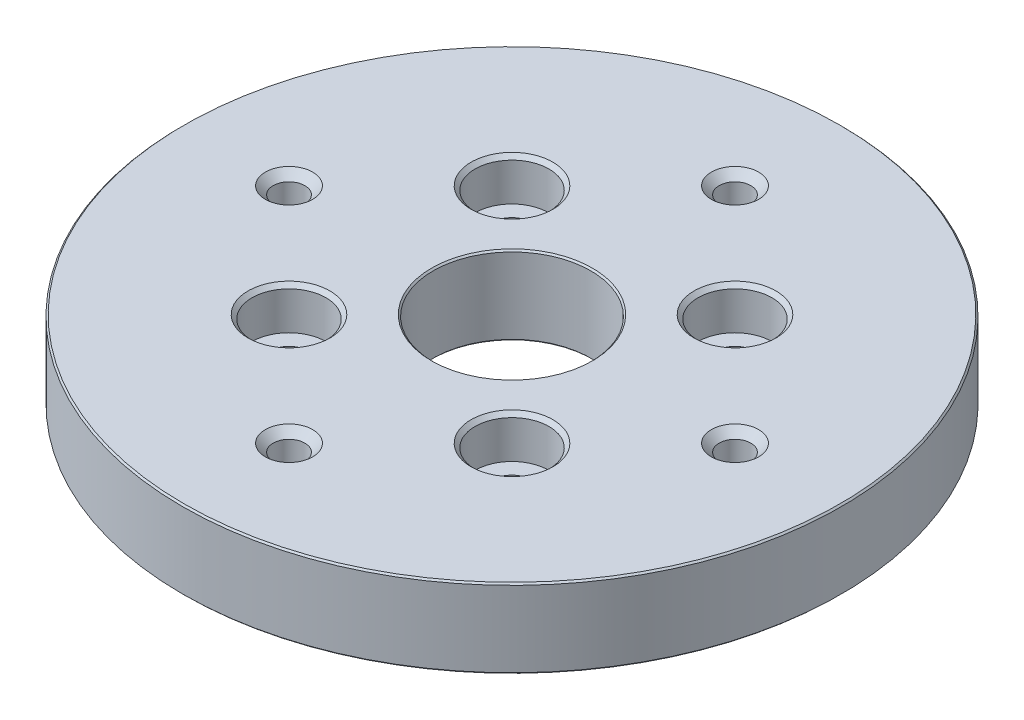
ISO-10303-21;
HEADER;
FILE_DESCRIPTION(('STEP AP214'),'2;1');
FILE_NAME('part.step','',(''),(''),'','','');
FILE_SCHEMA(('AUTOMOTIVE_DESIGN { 1 0 10303 214 1 1 1 1 }'));
ENDSEC;
DATA;
#1=APPLICATION_CONTEXT('core data for automotive mechanical design processes');
#2=APPLICATION_PROTOCOL_DEFINITION('international standard','automotive_design',2000,#1);
#3=PRODUCT_CONTEXT('',#1,'mechanical');
#4=PRODUCT('Part','Part','',(#3));
#5=PRODUCT_RELATED_PRODUCT_CATEGORY('part','',(#4));
#6=PRODUCT_DEFINITION_FORMATION('','',#4);
#7=PRODUCT_DEFINITION_CONTEXT('part definition',#1,'design');
#8=PRODUCT_DEFINITION('design','',#6,#7);
#9=PRODUCT_DEFINITION_SHAPE('','',#8);
#10=(LENGTH_UNIT() NAMED_UNIT(*) SI_UNIT(.MILLI.,.METRE.));
#11=(NAMED_UNIT(*) PLANE_ANGLE_UNIT() SI_UNIT($,.RADIAN.));
#12=(NAMED_UNIT(*) SI_UNIT($,.STERADIAN.) SOLID_ANGLE_UNIT());
#13=UNCERTAINTY_MEASURE_WITH_UNIT(LENGTH_MEASURE(1.E-05),#10,'distance_accuracy_value','');
#14=(GEOMETRIC_REPRESENTATION_CONTEXT(3) GLOBAL_UNCERTAINTY_ASSIGNED_CONTEXT((#13)) GLOBAL_UNIT_ASSIGNED_CONTEXT((#10,
#11,#12)) REPRESENTATION_CONTEXT('',''));
#15=CARTESIAN_POINT('',(0.,0.,0.));
#16=DIRECTION('',(0.,0.,1.));
#17=DIRECTION('',(1.,0.,0.));
#18=AXIS2_PLACEMENT_3D('',#15,#16,#17);
#19=CARTESIAN_POINT('',(0.,-12.7,0.));
#20=DIRECTION('',(0.,1.,0.));
#21=DIRECTION('',(0.,0.,1.));
#22=AXIS2_PLACEMENT_3D('',#19,#20,#21);
#23=CYLINDRICAL_SURFACE('',#22,53.086);
#24=CARTESIAN_POINT('',(0.,-12.446,0.));
#25=DIRECTION('',(0.,1.,0.));
#26=DIRECTION('',(0.,0.,1.));
#27=AXIS2_PLACEMENT_3D('',#24,#25,#26);
#28=CIRCLE('',#27,53.086);
#29=CARTESIAN_POINT('',(0.,-12.446,53.086));
#30=VERTEX_POINT('',#29);
#31=EDGE_CURVE('E61',#30,#30,#28,.T.);
#32=ORIENTED_EDGE('',*,*,#31,.T.);
#33=EDGE_LOOP('',(#32));
#34=FACE_BOUND('',#33,.T.);
#35=CARTESIAN_POINT('',(0.,-0.253999999999983,0.));
#36=DIRECTION('',(0.,1.,0.));
#37=DIRECTION('',(0.,0.,1.));
#38=AXIS2_PLACEMENT_3D('',#35,#36,#37);
#39=CIRCLE('',#38,53.086);
#40=CARTESIAN_POINT('',(0.,-0.253999999999983,53.086));
#41=VERTEX_POINT('',#40);
#42=EDGE_CURVE('E64',#41,#41,#39,.F.);
#43=ORIENTED_EDGE('',*,*,#42,.T.);
#44=EDGE_LOOP('',(#43));
#45=FACE_BOUND('',#44,.T.);
#46=ADVANCED_FACE('F35',(#34,#45),#23,.T.);
#47=CARTESIAN_POINT('',(0.,-12.7,0.));
#48=DIRECTION('',(0.,1.,0.));
#49=DIRECTION('',(0.,0.,1.));
#50=AXIS2_PLACEMENT_3D('',#47,#48,#49);
#51=PLANE('',#50);
#52=CARTESIAN_POINT('',(0.,-12.7,0.));
#53=DIRECTION('',(0.,1.,0.));
#54=DIRECTION('',(0.,0.,1.));
#55=AXIS2_PLACEMENT_3D('',#52,#53,#54);
#56=CIRCLE('',#55,52.832);
#57=CARTESIAN_POINT('',(0.,-12.7,52.832));
#58=VERTEX_POINT('',#57);
#59=EDGE_CURVE('E55',#58,#58,#56,.F.);
#60=ORIENTED_EDGE('',*,*,#59,.T.);
#61=EDGE_LOOP('',(#60));
#62=FACE_BOUND('',#61,.T.);
#63=CARTESIAN_POINT('',(0.,-12.7,0.));
#64=DIRECTION('',(0.,1.,0.));
#65=DIRECTION('',(0.,0.,1.));
#66=AXIS2_PLACEMENT_3D('',#63,#64,#65);
#67=CIRCLE('',#66,12.954);
#68=CARTESIAN_POINT('',(0.,-12.7,12.954));
#69=VERTEX_POINT('',#68);
#70=EDGE_CURVE('E58',#69,#69,#67,.T.);
#71=ORIENTED_EDGE('',*,*,#70,.T.);
#72=EDGE_LOOP('',(#71));
#73=FACE_BOUND('',#72,.T.);
#74=CARTESIAN_POINT('',(-17.9605122421383,-12.7,17.9605122421383));
#75=DIRECTION('',(0.,1.,0.));
#76=DIRECTION('',(0.,0.,1.));
#77=AXIS2_PLACEMENT_3D('',#74,#75,#76);
#78=CIRCLE('',#77,3.8989);
#79=CARTESIAN_POINT('',(-17.9605122421383,-12.7,21.8594122421383));
#80=VERTEX_POINT('',#79);
#81=EDGE_CURVE('E184',#80,#80,#78,.T.);
#82=ORIENTED_EDGE('',*,*,#81,.T.);
#83=EDGE_LOOP('',(#82));
#84=FACE_BOUND('',#83,.T.);
#85=CARTESIAN_POINT('',(-17.9605122421383,-12.7,-17.9605122421383));
#86=DIRECTION('',(0.,1.,0.));
#87=DIRECTION('',(0.,0.,1.));
#88=AXIS2_PLACEMENT_3D('',#85,#86,#87);
#89=CIRCLE('',#88,3.8989);
#90=CARTESIAN_POINT('',(-17.9605122421383,-12.7,-14.0616122421383));
#91=VERTEX_POINT('',#90);
#92=EDGE_CURVE('E166',#91,#91,#89,.T.);
#93=ORIENTED_EDGE('',*,*,#92,.T.);
#94=EDGE_LOOP('',(#93));
#95=FACE_BOUND('',#94,.T.);
#96=CARTESIAN_POINT('',(17.9605122421383,-12.7,-17.9605122421383));
#97=DIRECTION('',(0.,1.,0.));
#98=DIRECTION('',(0.,0.,1.));
#99=AXIS2_PLACEMENT_3D('',#96,#97,#98);
#100=CIRCLE('',#99,3.8989);
#101=CARTESIAN_POINT('',(17.9605122421383,-12.7,-14.0616122421383));
#102=VERTEX_POINT('',#101);
#103=EDGE_CURVE('E148',#102,#102,#100,.T.);
#104=ORIENTED_EDGE('',*,*,#103,.T.);
#105=EDGE_LOOP('',(#104));
#106=FACE_BOUND('',#105,.T.);
#107=CARTESIAN_POINT('',(17.9605122421383,-12.7,17.9605122421383));
#108=DIRECTION('',(0.,1.,0.));
#109=DIRECTION('',(0.,0.,1.));
#110=AXIS2_PLACEMENT_3D('',#107,#108,#109);
#111=CIRCLE('',#110,3.8989);
#112=CARTESIAN_POINT('',(17.9605122421383,-12.7,21.8594122421383));
#113=VERTEX_POINT('',#112);
#114=EDGE_CURVE('E130',#113,#113,#111,.T.);
#115=ORIENTED_EDGE('',*,*,#114,.T.);
#116=EDGE_LOOP('',(#115));
#117=FACE_BOUND('',#116,.T.);
#118=CARTESIAN_POINT('',(0.,-12.7,35.9210244842766));
#119=DIRECTION('',(0.,1.,0.));
#120=DIRECTION('',(0.,0.,1.));
#121=AXIS2_PLACEMENT_3D('',#118,#119,#120);
#122=CIRCLE('',#121,3.81);
#123=CARTESIAN_POINT('',(0.,-12.7,39.7310244842766));
#124=VERTEX_POINT('',#123);
#125=EDGE_CURVE('E112',#124,#124,#122,.T.);
#126=ORIENTED_EDGE('',*,*,#125,.T.);
#127=EDGE_LOOP('',(#126));
#128=FACE_BOUND('',#127,.T.);
#129=CARTESIAN_POINT('',(-35.9210244842766,-12.7,0.));
#130=DIRECTION('',(0.,1.,0.));
#131=DIRECTION('',(0.,0.,1.));
#132=AXIS2_PLACEMENT_3D('',#129,#130,#131);
#133=CIRCLE('',#132,3.80999999999999);
#134=CARTESIAN_POINT('',(-35.9210244842766,-12.7,3.80999999999999));
#135=VERTEX_POINT('',#134);
#136=EDGE_CURVE('E100',#135,#135,#133,.T.);
#137=ORIENTED_EDGE('',*,*,#136,.T.);
#138=EDGE_LOOP('',(#137));
#139=FACE_BOUND('',#138,.T.);
#140=CARTESIAN_POINT('',(0.,-12.7,-35.9210244842766));
#141=DIRECTION('',(0.,1.,0.));
#142=DIRECTION('',(0.,0.,1.));
#143=AXIS2_PLACEMENT_3D('',#140,#141,#142);
#144=CIRCLE('',#143,3.81);
#145=CARTESIAN_POINT('',(0.,-12.7,-32.1110244842766));
#146=VERTEX_POINT('',#145);
#147=EDGE_CURVE('E88',#146,#146,#144,.T.);
#148=ORIENTED_EDGE('',*,*,#147,.T.);
#149=EDGE_LOOP('',(#148));
#150=FACE_BOUND('',#149,.T.);
#151=CARTESIAN_POINT('',(35.9210244842766,-12.7,0.));
#152=DIRECTION('',(0.,1.,0.));
#153=DIRECTION('',(0.,0.,1.));
#154=AXIS2_PLACEMENT_3D('',#151,#152,#153);
#155=CIRCLE('',#154,3.80999999999999);
#156=CARTESIAN_POINT('',(35.9210244842766,-12.7,3.80999999999999));
#157=VERTEX_POINT('',#156);
#158=EDGE_CURVE('E76',#157,#157,#155,.T.);
#159=ORIENTED_EDGE('',*,*,#158,.T.);
#160=EDGE_LOOP('',(#159));
#161=FACE_BOUND('',#160,.T.);
#162=ADVANCED_FACE('F188',(#62,#73,#84,#95,#106,#117,#128,#139,#150,#161),#51,.F.);
#163=CARTESIAN_POINT('',(0.,0.,0.));
#164=DIRECTION('',(0.,1.,0.));
#165=DIRECTION('',(0.,0.,1.));
#166=AXIS2_PLACEMENT_3D('',#163,#164,#165);
#167=PLANE('',#166);
#168=CARTESIAN_POINT('',(0.,0.,0.));
#169=DIRECTION('',(0.,1.,0.));
#170=DIRECTION('',(0.,0.,1.));
#171=AXIS2_PLACEMENT_3D('',#168,#169,#170);
#172=CIRCLE('',#171,52.832);
#173=CARTESIAN_POINT('',(0.,0.,52.832));
#174=VERTEX_POINT('',#173);
#175=EDGE_CURVE('E46',#174,#174,#172,.T.);
#176=ORIENTED_EDGE('',*,*,#175,.T.);
#177=EDGE_LOOP('',(#176));
#178=FACE_BOUND('',#177,.T.);
#179=CARTESIAN_POINT('',(0.,0.,0.));
#180=DIRECTION('',(0.,1.,0.));
#181=DIRECTION('',(0.,0.,1.));
#182=AXIS2_PLACEMENT_3D('',#179,#180,#181);
#183=CIRCLE('',#182,12.954);
#184=CARTESIAN_POINT('',(0.,0.,12.954));
#185=VERTEX_POINT('',#184);
#186=EDGE_CURVE('E50',#185,#185,#183,.F.);
#187=ORIENTED_EDGE('',*,*,#186,.T.);
#188=EDGE_LOOP('',(#187));
#189=FACE_BOUND('',#188,.T.);
#190=CARTESIAN_POINT('',(-17.9605122421383,0.,17.9605122421383));
#191=DIRECTION('',(0.,1.,0.));
#192=DIRECTION('',(0.,0.,1.));
#193=AXIS2_PLACEMENT_3D('',#190,#191,#192);
#194=CIRCLE('',#193,6.58876);
#195=CARTESIAN_POINT('',(-17.9605122421383,0.,24.5492722421383));
#196=VERTEX_POINT('',#195);
#197=EDGE_CURVE('E181',#196,#196,#194,.T.);
#198=ORIENTED_EDGE('',*,*,#197,.F.);
#199=EDGE_LOOP('',(#198));
#200=FACE_BOUND('',#199,.T.);
#201=CARTESIAN_POINT('',(-17.9605122421383,0.,-17.9605122421383));
#202=DIRECTION('',(0.,1.,0.));
#203=DIRECTION('',(0.,0.,1.));
#204=AXIS2_PLACEMENT_3D('',#201,#202,#203);
#205=CIRCLE('',#204,6.58876);
#206=CARTESIAN_POINT('',(-17.9605122421383,0.,-11.3717522421383));
#207=VERTEX_POINT('',#206);
#208=EDGE_CURVE('E163',#207,#207,#205,.T.);
#209=ORIENTED_EDGE('',*,*,#208,.F.);
#210=EDGE_LOOP('',(#209));
#211=FACE_BOUND('',#210,.T.);
#212=CARTESIAN_POINT('',(17.9605122421383,0.,-17.9605122421383));
#213=DIRECTION('',(0.,1.,0.));
#214=DIRECTION('',(0.,0.,1.));
#215=AXIS2_PLACEMENT_3D('',#212,#213,#214);
#216=CIRCLE('',#215,6.58876);
#217=CARTESIAN_POINT('',(17.9605122421383,0.,-11.3717522421383));
#218=VERTEX_POINT('',#217);
#219=EDGE_CURVE('E145',#218,#218,#216,.T.);
#220=ORIENTED_EDGE('',*,*,#219,.F.);
#221=EDGE_LOOP('',(#220));
#222=FACE_BOUND('',#221,.T.);
#223=CARTESIAN_POINT('',(17.9605122421383,0.,17.9605122421383));
#224=DIRECTION('',(0.,1.,0.));
#225=DIRECTION('',(0.,0.,1.));
#226=AXIS2_PLACEMENT_3D('',#223,#224,#225);
#227=CIRCLE('',#226,6.58876);
#228=CARTESIAN_POINT('',(17.9605122421383,0.,24.5492722421383));
#229=VERTEX_POINT('',#228);
#230=EDGE_CURVE('E127',#229,#229,#227,.T.);
#231=ORIENTED_EDGE('',*,*,#230,.F.);
#232=EDGE_LOOP('',(#231));
#233=FACE_BOUND('',#232,.T.);
#234=CARTESIAN_POINT('',(0.,0.,35.9210244842766));
#235=DIRECTION('',(0.,1.,0.));
#236=DIRECTION('',(0.,0.,1.));
#237=AXIS2_PLACEMENT_3D('',#234,#235,#236);
#238=CIRCLE('',#237,3.81);
#239=CARTESIAN_POINT('',(0.,0.,39.7310244842766));
#240=VERTEX_POINT('',#239);
#241=EDGE_CURVE('E109',#240,#240,#238,.T.);
#242=ORIENTED_EDGE('',*,*,#241,.F.);
#243=EDGE_LOOP('',(#242));
#244=FACE_BOUND('',#243,.T.);
#245=CARTESIAN_POINT('',(-35.9210244842766,0.,0.));
#246=DIRECTION('',(0.,1.,0.));
#247=DIRECTION('',(0.,0.,1.));
#248=AXIS2_PLACEMENT_3D('',#245,#246,#247);
#249=CIRCLE('',#248,3.81);
#250=CARTESIAN_POINT('',(-35.9210244842766,0.,3.81));
#251=VERTEX_POINT('',#250);
#252=EDGE_CURVE('E97',#251,#251,#249,.T.);
#253=ORIENTED_EDGE('',*,*,#252,.F.);
#254=EDGE_LOOP('',(#253));
#255=FACE_BOUND('',#254,.T.);
#256=CARTESIAN_POINT('',(0.,0.,-35.9210244842766));
#257=DIRECTION('',(0.,1.,0.));
#258=DIRECTION('',(0.,0.,1.));
#259=AXIS2_PLACEMENT_3D('',#256,#257,#258);
#260=CIRCLE('',#259,3.81);
#261=CARTESIAN_POINT('',(0.,0.,-32.1110244842766));
#262=VERTEX_POINT('',#261);
#263=EDGE_CURVE('E85',#262,#262,#260,.T.);
#264=ORIENTED_EDGE('',*,*,#263,.F.);
#265=EDGE_LOOP('',(#264));
#266=FACE_BOUND('',#265,.T.);
#267=CARTESIAN_POINT('',(35.9210244842766,0.,0.));
#268=DIRECTION('',(0.,1.,0.));
#269=DIRECTION('',(0.,0.,1.));
#270=AXIS2_PLACEMENT_3D('',#267,#268,#269);
#271=CIRCLE('',#270,3.81);
#272=CARTESIAN_POINT('',(35.9210244842766,0.,3.81));
#273=VERTEX_POINT('',#272);
#274=EDGE_CURVE('E73',#273,#273,#271,.T.);
#275=ORIENTED_EDGE('',*,*,#274,.F.);
#276=EDGE_LOOP('',(#275));
#277=FACE_BOUND('',#276,.T.);
#278=ADVANCED_FACE('F223',(#178,#189,#200,#211,#222,#233,#244,#255,#266,#277),#167,.T.);
#279=CARTESIAN_POINT('',(0.,-12.7,0.));
#280=DIRECTION('',(0.,1.,0.));
#281=DIRECTION('',(0.,0.,1.));
#282=AXIS2_PLACEMENT_3D('',#279,#280,#281);
#283=CYLINDRICAL_SURFACE('',#282,12.7);
#284=CARTESIAN_POINT('',(0.,-12.446,0.));
#285=DIRECTION('',(0.,1.,0.));
#286=DIRECTION('',(0.,0.,1.));
#287=AXIS2_PLACEMENT_3D('',#284,#285,#286);
#288=CIRCLE('',#287,12.7);
#289=CARTESIAN_POINT('',(0.,-12.446,12.7));
#290=VERTEX_POINT('',#289);
#291=EDGE_CURVE('E10',#290,#290,#288,.F.);
#292=ORIENTED_EDGE('',*,*,#291,.T.);
#293=EDGE_LOOP('',(#292));
#294=FACE_BOUND('',#293,.T.);
#295=CARTESIAN_POINT('',(0.,-0.253999999999997,0.));
#296=DIRECTION('',(0.,1.,0.));
#297=DIRECTION('',(0.,0.,1.));
#298=AXIS2_PLACEMENT_3D('',#295,#296,#297);
#299=CIRCLE('',#298,12.7);
#300=CARTESIAN_POINT('',(0.,-0.253999999999997,12.7));
#301=VERTEX_POINT('',#300);
#302=EDGE_CURVE('E42',#301,#301,#299,.T.);
#303=ORIENTED_EDGE('',*,*,#302,.T.);
#304=EDGE_LOOP('',(#303));
#305=FACE_BOUND('',#304,.T.);
#306=ADVANCED_FACE('F226',(#294,#305),#283,.F.);
#307=CARTESIAN_POINT('',(35.9210244842766,-11.4427,0.));
#308=DIRECTION('',(0.,-1.,0.));
#309=DIRECTION('',(0.,0.,-1.));
#310=AXIS2_PLACEMENT_3D('',#307,#308,#309);
#311=CONICAL_SURFACE('',#310,2.5527,0.785398163397446);
#312=ORIENTED_EDGE('',*,*,#158,.F.);
#313=EDGE_LOOP('',(#312));
#314=FACE_BOUND('',#313,.T.);
#315=CARTESIAN_POINT('',(35.9210244842766,-11.4427,0.));
#316=DIRECTION('',(0.,1.,0.));
#317=DIRECTION('',(0.,0.,1.));
#318=AXIS2_PLACEMENT_3D('',#315,#316,#317);
#319=CIRCLE('',#318,2.5527);
#320=CARTESIAN_POINT('',(35.9210244842766,-11.4427,2.55269999999999));
#321=VERTEX_POINT('',#320);
#322=EDGE_CURVE('E67',#321,#321,#319,.T.);
#323=ORIENTED_EDGE('',*,*,#322,.T.);
#324=EDGE_LOOP('',(#323));
#325=FACE_BOUND('',#324,.T.);
#326=ADVANCED_FACE('F256',(#314,#325),#311,.F.);
#327=CARTESIAN_POINT('',(35.9210244842766,0.,0.));
#328=DIRECTION('',(0.,1.,0.));
#329=DIRECTION('',(0.,0.,1.));
#330=AXIS2_PLACEMENT_3D('',#327,#328,#329);
#331=CYLINDRICAL_SURFACE('',#330,2.5527);
#332=ORIENTED_EDGE('',*,*,#322,.F.);
#333=EDGE_LOOP('',(#332));
#334=FACE_BOUND('',#333,.T.);
#335=CARTESIAN_POINT('',(35.9210244842766,-1.2573,0.));
#336=DIRECTION('',(0.,1.,0.));
#337=DIRECTION('',(0.,0.,1.));
#338=AXIS2_PLACEMENT_3D('',#335,#336,#337);
#339=CIRCLE('',#338,2.5527);
#340=CARTESIAN_POINT('',(35.9210244842766,-1.2573,2.55269999999999));
#341=VERTEX_POINT('',#340);
#342=EDGE_CURVE('E70',#341,#341,#339,.T.);
#343=ORIENTED_EDGE('',*,*,#342,.T.);
#344=EDGE_LOOP('',(#343));
#345=FACE_BOUND('',#344,.T.);
#346=ADVANCED_FACE('F246',(#334,#345),#331,.F.);
#347=CARTESIAN_POINT('',(35.9210244842766,0.,0.));
#348=DIRECTION('',(0.,1.,0.));
#349=DIRECTION('',(0.,0.,1.));
#350=AXIS2_PLACEMENT_3D('',#347,#348,#349);
#351=CONICAL_SURFACE('',#350,3.81,0.785398163397448);
#352=ORIENTED_EDGE('',*,*,#342,.F.);
#353=EDGE_LOOP('',(#352));
#354=FACE_BOUND('',#353,.T.);
#355=ORIENTED_EDGE('',*,*,#274,.T.);
#356=EDGE_LOOP('',(#355));
#357=FACE_BOUND('',#356,.T.);
#358=ADVANCED_FACE('F243',(#354,#357),#351,.F.);
#359=CARTESIAN_POINT('',(0.,-11.4427,-35.9210244842766));
#360=DIRECTION('',(0.,-1.,0.));
#361=DIRECTION('',(0.,0.,-1.));
#362=AXIS2_PLACEMENT_3D('',#359,#360,#361);
#363=CONICAL_SURFACE('',#362,2.5527,0.785398163397447);
#364=ORIENTED_EDGE('',*,*,#147,.F.);
#365=EDGE_LOOP('',(#364));
#366=FACE_BOUND('',#365,.T.);
#367=CARTESIAN_POINT('',(0.,-11.4427,-35.9210244842766));
#368=DIRECTION('',(0.,1.,0.));
#369=DIRECTION('',(0.,0.,1.));
#370=AXIS2_PLACEMENT_3D('',#367,#368,#369);
#371=CIRCLE('',#370,2.5527);
#372=CARTESIAN_POINT('',(0.,-11.4427,-33.3683244842766));
#373=VERTEX_POINT('',#372);
#374=EDGE_CURVE('E79',#373,#373,#371,.T.);
#375=ORIENTED_EDGE('',*,*,#374,.T.);
#376=EDGE_LOOP('',(#375));
#377=FACE_BOUND('',#376,.T.);
#378=ADVANCED_FACE('F245',(#366,#377),#363,.F.);
#379=CARTESIAN_POINT('',(0.,0.,-35.9210244842766));
#380=DIRECTION('',(0.,1.,0.));
#381=DIRECTION('',(0.,0.,1.));
#382=AXIS2_PLACEMENT_3D('',#379,#380,#381);
#383=CYLINDRICAL_SURFACE('',#382,2.5527);
#384=ORIENTED_EDGE('',*,*,#374,.F.);
#385=EDGE_LOOP('',(#384));
#386=FACE_BOUND('',#385,.T.);
#387=CARTESIAN_POINT('',(0.,-1.2573,-35.9210244842766));
#388=DIRECTION('',(0.,1.,0.));
#389=DIRECTION('',(0.,0.,1.));
#390=AXIS2_PLACEMENT_3D('',#387,#388,#389);
#391=CIRCLE('',#390,2.5527);
#392=CARTESIAN_POINT('',(0.,-1.2573,-33.3683244842766));
#393=VERTEX_POINT('',#392);
#394=EDGE_CURVE('E82',#393,#393,#391,.T.);
#395=ORIENTED_EDGE('',*,*,#394,.T.);
#396=EDGE_LOOP('',(#395));
#397=FACE_BOUND('',#396,.T.);
#398=ADVANCED_FACE('F253',(#386,#397),#383,.F.);
#399=CARTESIAN_POINT('',(0.,0.,-35.9210244842766));
#400=DIRECTION('',(0.,1.,0.));
#401=DIRECTION('',(0.,0.,1.));
#402=AXIS2_PLACEMENT_3D('',#399,#400,#401);
#403=CONICAL_SURFACE('',#402,3.81,0.785398163397447);
#404=ORIENTED_EDGE('',*,*,#394,.F.);
#405=EDGE_LOOP('',(#404));
#406=FACE_BOUND('',#405,.T.);
#407=ORIENTED_EDGE('',*,*,#263,.T.);
#408=EDGE_LOOP('',(#407));
#409=FACE_BOUND('',#408,.T.);
#410=ADVANCED_FACE('F575',(#406,#409),#403,.F.);
#411=CARTESIAN_POINT('',(-35.9210244842766,-11.4427,0.));
#412=DIRECTION('',(0.,-1.,0.));
#413=DIRECTION('',(0.,0.,-1.));
#414=AXIS2_PLACEMENT_3D('',#411,#412,#413);
#415=CONICAL_SURFACE('',#414,2.5527,0.785398163397446);
#416=ORIENTED_EDGE('',*,*,#136,.F.);
#417=EDGE_LOOP('',(#416));
#418=FACE_BOUND('',#417,.T.);
#419=CARTESIAN_POINT('',(-35.9210244842766,-11.4427,0.));
#420=DIRECTION('',(0.,1.,0.));
#421=DIRECTION('',(0.,0.,1.));
#422=AXIS2_PLACEMENT_3D('',#419,#420,#421);
#423=CIRCLE('',#422,2.5527);
#424=CARTESIAN_POINT('',(-35.9210244842766,-11.4427,2.55269999999999));
#425=VERTEX_POINT('',#424);
#426=EDGE_CURVE('E91',#425,#425,#423,.T.);
#427=ORIENTED_EDGE('',*,*,#426,.T.);
#428=EDGE_LOOP('',(#427));
#429=FACE_BOUND('',#428,.T.);
#430=ADVANCED_FACE('F564',(#418,#429),#415,.F.);
#431=CARTESIAN_POINT('',(-35.9210244842766,0.,0.));
#432=DIRECTION('',(0.,1.,0.));
#433=DIRECTION('',(0.,0.,1.));
#434=AXIS2_PLACEMENT_3D('',#431,#432,#433);
#435=CYLINDRICAL_SURFACE('',#434,2.5527);
#436=ORIENTED_EDGE('',*,*,#426,.F.);
#437=EDGE_LOOP('',(#436));
#438=FACE_BOUND('',#437,.T.);
#439=CARTESIAN_POINT('',(-35.9210244842766,-1.2573,0.));
#440=DIRECTION('',(0.,1.,0.));
#441=DIRECTION('',(0.,0.,1.));
#442=AXIS2_PLACEMENT_3D('',#439,#440,#441);
#443=CIRCLE('',#442,2.5527);
#444=CARTESIAN_POINT('',(-35.9210244842766,-1.2573,2.55269999999999));
#445=VERTEX_POINT('',#444);
#446=EDGE_CURVE('E94',#445,#445,#443,.T.);
#447=ORIENTED_EDGE('',*,*,#446,.T.);
#448=EDGE_LOOP('',(#447));
#449=FACE_BOUND('',#448,.T.);
#450=ADVANCED_FACE('F554',(#438,#449),#435,.F.);
#451=CARTESIAN_POINT('',(-35.9210244842766,0.,0.));
#452=DIRECTION('',(0.,1.,0.));
#453=DIRECTION('',(0.,0.,1.));
#454=AXIS2_PLACEMENT_3D('',#451,#452,#453);
#455=CONICAL_SURFACE('',#454,3.81,0.785398163397448);
#456=ORIENTED_EDGE('',*,*,#446,.F.);
#457=EDGE_LOOP('',(#456));
#458=FACE_BOUND('',#457,.T.);
#459=ORIENTED_EDGE('',*,*,#252,.T.);
#460=EDGE_LOOP('',(#459));
#461=FACE_BOUND('',#460,.T.);
#462=ADVANCED_FACE('F544',(#458,#461),#455,.F.);
#463=CARTESIAN_POINT('',(0.,-11.4427,35.9210244842766));
#464=DIRECTION('',(0.,-1.,0.));
#465=DIRECTION('',(0.,0.,-1.));
#466=AXIS2_PLACEMENT_3D('',#463,#464,#465);
#467=CONICAL_SURFACE('',#466,2.5527,0.785398163397447);
#468=ORIENTED_EDGE('',*,*,#125,.F.);
#469=EDGE_LOOP('',(#468));
#470=FACE_BOUND('',#469,.T.);
#471=CARTESIAN_POINT('',(0.,-11.4427,35.9210244842766));
#472=DIRECTION('',(0.,1.,0.));
#473=DIRECTION('',(0.,0.,1.));
#474=AXIS2_PLACEMENT_3D('',#471,#472,#473);
#475=CIRCLE('',#474,2.5527);
#476=CARTESIAN_POINT('',(0.,-11.4427,38.4737244842766));
#477=VERTEX_POINT('',#476);
#478=EDGE_CURVE('E103',#477,#477,#475,.T.);
#479=ORIENTED_EDGE('',*,*,#478,.T.);
#480=EDGE_LOOP('',(#479));
#481=FACE_BOUND('',#480,.T.);
#482=ADVANCED_FACE('F533',(#470,#481),#467,.F.);
#483=CARTESIAN_POINT('',(0.,0.,35.9210244842766));
#484=DIRECTION('',(0.,1.,0.));
#485=DIRECTION('',(0.,0.,1.));
#486=AXIS2_PLACEMENT_3D('',#483,#484,#485);
#487=CYLINDRICAL_SURFACE('',#486,2.5527);
#488=ORIENTED_EDGE('',*,*,#478,.F.);
#489=EDGE_LOOP('',(#488));
#490=FACE_BOUND('',#489,.T.);
#491=CARTESIAN_POINT('',(0.,-1.2573,35.9210244842766));
#492=DIRECTION('',(0.,1.,0.));
#493=DIRECTION('',(0.,0.,1.));
#494=AXIS2_PLACEMENT_3D('',#491,#492,#493);
#495=CIRCLE('',#494,2.5527);
#496=CARTESIAN_POINT('',(0.,-1.2573,38.4737244842766));
#497=VERTEX_POINT('',#496);
#498=EDGE_CURVE('E106',#497,#497,#495,.T.);
#499=ORIENTED_EDGE('',*,*,#498,.T.);
#500=EDGE_LOOP('',(#499));
#501=FACE_BOUND('',#500,.T.);
#502=ADVANCED_FACE('F522',(#490,#501),#487,.F.);
#503=CARTESIAN_POINT('',(0.,0.,35.9210244842766));
#504=DIRECTION('',(0.,1.,0.));
#505=DIRECTION('',(0.,0.,1.));
#506=AXIS2_PLACEMENT_3D('',#503,#504,#505);
#507=CONICAL_SURFACE('',#506,3.81,0.785398163397447);
#508=ORIENTED_EDGE('',*,*,#498,.F.);
#509=EDGE_LOOP('',(#508));
#510=FACE_BOUND('',#509,.T.);
#511=ORIENTED_EDGE('',*,*,#241,.T.);
#512=EDGE_LOOP('',(#511));
#513=FACE_BOUND('',#512,.T.);
#514=ADVANCED_FACE('F512',(#510,#513),#507,.F.);
#515=CARTESIAN_POINT('',(17.9605122421383,-12.065,17.9605122421383));
#516=DIRECTION('',(0.,-1.,0.));
#517=DIRECTION('',(0.,0.,-1.));
#518=AXIS2_PLACEMENT_3D('',#515,#516,#517);
#519=CONICAL_SURFACE('',#518,3.2639,0.785398163397447);
#520=ORIENTED_EDGE('',*,*,#114,.F.);
#521=EDGE_LOOP('',(#520));
#522=FACE_BOUND('',#521,.T.);
#523=CARTESIAN_POINT('',(17.9605122421383,-12.065,17.9605122421383));
#524=DIRECTION('',(0.,1.,0.));
#525=DIRECTION('',(0.,0.,1.));
#526=AXIS2_PLACEMENT_3D('',#523,#524,#525);
#527=CIRCLE('',#526,3.2639);
#528=CARTESIAN_POINT('',(17.9605122421383,-12.065,21.2244122421383));
#529=VERTEX_POINT('',#528);
#530=EDGE_CURVE('E115',#529,#529,#527,.T.);
#531=ORIENTED_EDGE('',*,*,#530,.T.);
#532=EDGE_LOOP('',(#531));
#533=FACE_BOUND('',#532,.T.);
#534=ADVANCED_FACE('F502',(#522,#533),#519,.F.);
#535=CARTESIAN_POINT('',(17.9605122421383,0.,17.9605122421383));
#536=DIRECTION('',(0.,1.,0.));
#537=DIRECTION('',(0.,0.,1.));
#538=AXIS2_PLACEMENT_3D('',#535,#536,#537);
#539=CYLINDRICAL_SURFACE('',#538,3.2639);
#540=ORIENTED_EDGE('',*,*,#530,.F.);
#541=EDGE_LOOP('',(#540));
#542=FACE_BOUND('',#541,.T.);
#543=CARTESIAN_POINT('',(17.9605122421383,-6.7564,17.9605122421383));
#544=DIRECTION('',(0.,1.,0.));
#545=DIRECTION('',(0.,0.,1.));
#546=AXIS2_PLACEMENT_3D('',#543,#544,#545);
#547=CIRCLE('',#546,3.2639);
#548=CARTESIAN_POINT('',(17.9605122421383,-6.7564,21.2244122421383));
#549=VERTEX_POINT('',#548);
#550=EDGE_CURVE('E118',#549,#549,#547,.T.);
#551=ORIENTED_EDGE('',*,*,#550,.T.);
#552=EDGE_LOOP('',(#551));
#553=FACE_BOUND('',#552,.T.);
#554=ADVANCED_FACE('F492',(#542,#553),#539,.F.);
#555=CARTESIAN_POINT('',(23.9142722421383,-6.7564,17.9605122421383));
#556=DIRECTION('',(0.,-1.,0.));
#557=DIRECTION('',(0.,0.,-1.));
#558=AXIS2_PLACEMENT_3D('',#555,#556,#557);
#559=PLANE('',#558);
#560=ORIENTED_EDGE('',*,*,#550,.F.);
#561=EDGE_LOOP('',(#560));
#562=FACE_BOUND('',#561,.T.);
#563=CARTESIAN_POINT('',(17.9605122421383,-6.7564,17.9605122421383));
#564=DIRECTION('',(0.,1.,0.));
#565=DIRECTION('',(0.,0.,1.));
#566=AXIS2_PLACEMENT_3D('',#563,#564,#565);
#567=CIRCLE('',#566,5.95376);
#568=CARTESIAN_POINT('',(17.9605122421383,-6.7564,23.9142722421383));
#569=VERTEX_POINT('',#568);
#570=EDGE_CURVE('E121',#569,#569,#567,.T.);
#571=ORIENTED_EDGE('',*,*,#570,.T.);
#572=EDGE_LOOP('',(#571));
#573=FACE_BOUND('',#572,.T.);
#574=ADVANCED_FACE('F482',(#562,#573),#559,.F.);
#575=CARTESIAN_POINT('',(17.9605122421383,0.,17.9605122421383));
#576=DIRECTION('',(0.,1.,0.));
#577=DIRECTION('',(0.,0.,1.));
#578=AXIS2_PLACEMENT_3D('',#575,#576,#577);
#579=CYLINDRICAL_SURFACE('',#578,5.95376);
#580=ORIENTED_EDGE('',*,*,#570,.F.);
#581=EDGE_LOOP('',(#580));
#582=FACE_BOUND('',#581,.T.);
#583=CARTESIAN_POINT('',(17.9605122421383,-0.635000000000002,17.9605122421383));
#584=DIRECTION('',(0.,1.,0.));
#585=DIRECTION('',(0.,0.,1.));
#586=AXIS2_PLACEMENT_3D('',#583,#584,#585);
#587=CIRCLE('',#586,5.95376);
#588=CARTESIAN_POINT('',(17.9605122421383,-0.635000000000002,23.9142722421383));
#589=VERTEX_POINT('',#588);
#590=EDGE_CURVE('E124',#589,#589,#587,.T.);
#591=ORIENTED_EDGE('',*,*,#590,.T.);
#592=EDGE_LOOP('',(#591));
#593=FACE_BOUND('',#592,.T.);
#594=ADVANCED_FACE('F472',(#582,#593),#579,.F.);
#595=CARTESIAN_POINT('',(17.9605122421383,0.,17.9605122421383));
#596=DIRECTION('',(0.,1.,0.));
#597=DIRECTION('',(0.,0.,1.));
#598=AXIS2_PLACEMENT_3D('',#595,#596,#597);
#599=CONICAL_SURFACE('',#598,6.58876,0.785398163397445);
#600=ORIENTED_EDGE('',*,*,#590,.F.);
#601=EDGE_LOOP('',(#600));
#602=FACE_BOUND('',#601,.T.);
#603=ORIENTED_EDGE('',*,*,#230,.T.);
#604=EDGE_LOOP('',(#603));
#605=FACE_BOUND('',#604,.T.);
#606=ADVANCED_FACE('F462',(#602,#605),#599,.F.);
#607=CARTESIAN_POINT('',(17.9605122421383,-12.065,-17.9605122421383));
#608=DIRECTION('',(0.,-1.,0.));
#609=DIRECTION('',(0.,0.,-1.));
#610=AXIS2_PLACEMENT_3D('',#607,#608,#609);
#611=CONICAL_SURFACE('',#610,3.2639,0.785398163397447);
#612=ORIENTED_EDGE('',*,*,#103,.F.);
#613=EDGE_LOOP('',(#612));
#614=FACE_BOUND('',#613,.T.);
#615=CARTESIAN_POINT('',(17.9605122421383,-12.065,-17.9605122421383));
#616=DIRECTION('',(0.,1.,0.));
#617=DIRECTION('',(0.,0.,1.));
#618=AXIS2_PLACEMENT_3D('',#615,#616,#617);
#619=CIRCLE('',#618,3.2639);
#620=CARTESIAN_POINT('',(17.9605122421383,-12.065,-14.6966122421383));
#621=VERTEX_POINT('',#620);
#622=EDGE_CURVE('E133',#621,#621,#619,.T.);
#623=ORIENTED_EDGE('',*,*,#622,.T.);
#624=EDGE_LOOP('',(#623));
#625=FACE_BOUND('',#624,.T.);
#626=ADVANCED_FACE('F452',(#614,#625),#611,.F.);
#627=CARTESIAN_POINT('',(17.9605122421383,0.,-17.9605122421383));
#628=DIRECTION('',(0.,1.,0.));
#629=DIRECTION('',(0.,0.,1.));
#630=AXIS2_PLACEMENT_3D('',#627,#628,#629);
#631=CYLINDRICAL_SURFACE('',#630,3.2639);
#632=ORIENTED_EDGE('',*,*,#622,.F.);
#633=EDGE_LOOP('',(#632));
#634=FACE_BOUND('',#633,.T.);
#635=CARTESIAN_POINT('',(17.9605122421383,-6.7564,-17.9605122421383));
#636=DIRECTION('',(0.,1.,0.));
#637=DIRECTION('',(0.,0.,1.));
#638=AXIS2_PLACEMENT_3D('',#635,#636,#637);
#639=CIRCLE('',#638,3.2639);
#640=CARTESIAN_POINT('',(17.9605122421383,-6.7564,-14.6966122421383));
#641=VERTEX_POINT('',#640);
#642=EDGE_CURVE('E136',#641,#641,#639,.T.);
#643=ORIENTED_EDGE('',*,*,#642,.T.);
#644=EDGE_LOOP('',(#643));
#645=FACE_BOUND('',#644,.T.);
#646=ADVANCED_FACE('F442',(#634,#645),#631,.F.);
#647=CARTESIAN_POINT('',(23.9142722421383,-6.7564,-17.9605122421383));
#648=DIRECTION('',(0.,-1.,0.));
#649=DIRECTION('',(0.,0.,-1.));
#650=AXIS2_PLACEMENT_3D('',#647,#648,#649);
#651=PLANE('',#650);
#652=ORIENTED_EDGE('',*,*,#642,.F.);
#653=EDGE_LOOP('',(#652));
#654=FACE_BOUND('',#653,.T.);
#655=CARTESIAN_POINT('',(17.9605122421383,-6.7564,-17.9605122421383));
#656=DIRECTION('',(0.,1.,0.));
#657=DIRECTION('',(0.,0.,1.));
#658=AXIS2_PLACEMENT_3D('',#655,#656,#657);
#659=CIRCLE('',#658,5.95376);
#660=CARTESIAN_POINT('',(17.9605122421383,-6.7564,-12.0067522421383));
#661=VERTEX_POINT('',#660);
#662=EDGE_CURVE('E139',#661,#661,#659,.T.);
#663=ORIENTED_EDGE('',*,*,#662,.T.);
#664=EDGE_LOOP('',(#663));
#665=FACE_BOUND('',#664,.T.);
#666=ADVANCED_FACE('F432',(#654,#665),#651,.F.);
#667=CARTESIAN_POINT('',(17.9605122421383,0.,-17.9605122421383));
#668=DIRECTION('',(0.,1.,0.));
#669=DIRECTION('',(0.,0.,1.));
#670=AXIS2_PLACEMENT_3D('',#667,#668,#669);
#671=CYLINDRICAL_SURFACE('',#670,5.95376);
#672=ORIENTED_EDGE('',*,*,#662,.F.);
#673=EDGE_LOOP('',(#672));
#674=FACE_BOUND('',#673,.T.);
#675=CARTESIAN_POINT('',(17.9605122421383,-0.635000000000002,-17.9605122421383));
#676=DIRECTION('',(0.,1.,0.));
#677=DIRECTION('',(0.,0.,1.));
#678=AXIS2_PLACEMENT_3D('',#675,#676,#677);
#679=CIRCLE('',#678,5.95376);
#680=CARTESIAN_POINT('',(17.9605122421383,-0.635000000000002,-12.0067522421383));
#681=VERTEX_POINT('',#680);
#682=EDGE_CURVE('E142',#681,#681,#679,.T.);
#683=ORIENTED_EDGE('',*,*,#682,.T.);
#684=EDGE_LOOP('',(#683));
#685=FACE_BOUND('',#684,.T.);
#686=ADVANCED_FACE('F422',(#674,#685),#671,.F.);
#687=CARTESIAN_POINT('',(17.9605122421383,0.,-17.9605122421383));
#688=DIRECTION('',(0.,1.,0.));
#689=DIRECTION('',(0.,0.,1.));
#690=AXIS2_PLACEMENT_3D('',#687,#688,#689);
#691=CONICAL_SURFACE('',#690,6.58876,0.785398163397445);
#692=ORIENTED_EDGE('',*,*,#682,.F.);
#693=EDGE_LOOP('',(#692));
#694=FACE_BOUND('',#693,.T.);
#695=ORIENTED_EDGE('',*,*,#219,.T.);
#696=EDGE_LOOP('',(#695));
#697=FACE_BOUND('',#696,.T.);
#698=ADVANCED_FACE('F412',(#694,#697),#691,.F.);
#699=CARTESIAN_POINT('',(-17.9605122421383,-12.065,-17.9605122421383));
#700=DIRECTION('',(0.,-1.,0.));
#701=DIRECTION('',(0.,0.,-1.));
#702=AXIS2_PLACEMENT_3D('',#699,#700,#701);
#703=CONICAL_SURFACE('',#702,3.2639,0.785398163397447);
#704=ORIENTED_EDGE('',*,*,#92,.F.);
#705=EDGE_LOOP('',(#704));
#706=FACE_BOUND('',#705,.T.);
#707=CARTESIAN_POINT('',(-17.9605122421383,-12.065,-17.9605122421383));
#708=DIRECTION('',(0.,1.,0.));
#709=DIRECTION('',(0.,0.,1.));
#710=AXIS2_PLACEMENT_3D('',#707,#708,#709);
#711=CIRCLE('',#710,3.2639);
#712=CARTESIAN_POINT('',(-17.9605122421383,-12.065,-14.6966122421383));
#713=VERTEX_POINT('',#712);
#714=EDGE_CURVE('E151',#713,#713,#711,.T.);
#715=ORIENTED_EDGE('',*,*,#714,.T.);
#716=EDGE_LOOP('',(#715));
#717=FACE_BOUND('',#716,.T.);
#718=ADVANCED_FACE('F402',(#706,#717),#703,.F.);
#719=CARTESIAN_POINT('',(-17.9605122421383,0.,-17.9605122421383));
#720=DIRECTION('',(0.,1.,0.));
#721=DIRECTION('',(0.,0.,1.));
#722=AXIS2_PLACEMENT_3D('',#719,#720,#721);
#723=CYLINDRICAL_SURFACE('',#722,3.2639);
#724=ORIENTED_EDGE('',*,*,#714,.F.);
#725=EDGE_LOOP('',(#724));
#726=FACE_BOUND('',#725,.T.);
#727=CARTESIAN_POINT('',(-17.9605122421383,-6.7564,-17.9605122421383));
#728=DIRECTION('',(0.,1.,0.));
#729=DIRECTION('',(0.,0.,1.));
#730=AXIS2_PLACEMENT_3D('',#727,#728,#729);
#731=CIRCLE('',#730,3.2639);
#732=CARTESIAN_POINT('',(-17.9605122421383,-6.7564,-14.6966122421383));
#733=VERTEX_POINT('',#732);
#734=EDGE_CURVE('E154',#733,#733,#731,.T.);
#735=ORIENTED_EDGE('',*,*,#734,.T.);
#736=EDGE_LOOP('',(#735));
#737=FACE_BOUND('',#736,.T.);
#738=ADVANCED_FACE('F392',(#726,#737),#723,.F.);
#739=CARTESIAN_POINT('',(-12.0067522421383,-6.7564,-17.9605122421383));
#740=DIRECTION('',(0.,-1.,0.));
#741=DIRECTION('',(0.,0.,-1.));
#742=AXIS2_PLACEMENT_3D('',#739,#740,#741);
#743=PLANE('',#742);
#744=ORIENTED_EDGE('',*,*,#734,.F.);
#745=EDGE_LOOP('',(#744));
#746=FACE_BOUND('',#745,.T.);
#747=CARTESIAN_POINT('',(-17.9605122421383,-6.7564,-17.9605122421383));
#748=DIRECTION('',(0.,1.,0.));
#749=DIRECTION('',(0.,0.,1.));
#750=AXIS2_PLACEMENT_3D('',#747,#748,#749);
#751=CIRCLE('',#750,5.95376);
#752=CARTESIAN_POINT('',(-17.9605122421383,-6.7564,-12.0067522421383));
#753=VERTEX_POINT('',#752);
#754=EDGE_CURVE('E157',#753,#753,#751,.T.);
#755=ORIENTED_EDGE('',*,*,#754,.T.);
#756=EDGE_LOOP('',(#755));
#757=FACE_BOUND('',#756,.T.);
#758=ADVANCED_FACE('F382',(#746,#757),#743,.F.);
#759=CARTESIAN_POINT('',(-17.9605122421383,0.,-17.9605122421383));
#760=DIRECTION('',(0.,1.,0.));
#761=DIRECTION('',(0.,0.,1.));
#762=AXIS2_PLACEMENT_3D('',#759,#760,#761);
#763=CYLINDRICAL_SURFACE('',#762,5.95376);
#764=ORIENTED_EDGE('',*,*,#754,.F.);
#765=EDGE_LOOP('',(#764));
#766=FACE_BOUND('',#765,.T.);
#767=CARTESIAN_POINT('',(-17.9605122421383,-0.635000000000002,-17.9605122421383));
#768=DIRECTION('',(0.,1.,0.));
#769=DIRECTION('',(0.,0.,1.));
#770=AXIS2_PLACEMENT_3D('',#767,#768,#769);
#771=CIRCLE('',#770,5.95376);
#772=CARTESIAN_POINT('',(-17.9605122421383,-0.635000000000002,-12.0067522421383));
#773=VERTEX_POINT('',#772);
#774=EDGE_CURVE('E160',#773,#773,#771,.T.);
#775=ORIENTED_EDGE('',*,*,#774,.T.);
#776=EDGE_LOOP('',(#775));
#777=FACE_BOUND('',#776,.T.);
#778=ADVANCED_FACE('F372',(#766,#777),#763,.F.);
#779=CARTESIAN_POINT('',(-17.9605122421383,0.,-17.9605122421383));
#780=DIRECTION('',(0.,1.,0.));
#781=DIRECTION('',(0.,0.,1.));
#782=AXIS2_PLACEMENT_3D('',#779,#780,#781);
#783=CONICAL_SURFACE('',#782,6.58876,0.785398163397445);
#784=ORIENTED_EDGE('',*,*,#774,.F.);
#785=EDGE_LOOP('',(#784));
#786=FACE_BOUND('',#785,.T.);
#787=ORIENTED_EDGE('',*,*,#208,.T.);
#788=EDGE_LOOP('',(#787));
#789=FACE_BOUND('',#788,.T.);
#790=ADVANCED_FACE('F195',(#786,#789),#783,.F.);
#791=CARTESIAN_POINT('',(-17.9605122421383,-12.065,17.9605122421383));
#792=DIRECTION('',(0.,-1.,0.));
#793=DIRECTION('',(0.,0.,-1.));
#794=AXIS2_PLACEMENT_3D('',#791,#792,#793);
#795=CONICAL_SURFACE('',#794,3.2639,0.785398163397447);
#796=ORIENTED_EDGE('',*,*,#81,.F.);
#797=EDGE_LOOP('',(#796));
#798=FACE_BOUND('',#797,.T.);
#799=CARTESIAN_POINT('',(-17.9605122421383,-12.065,17.9605122421383));
#800=DIRECTION('',(0.,1.,0.));
#801=DIRECTION('',(0.,0.,1.));
#802=AXIS2_PLACEMENT_3D('',#799,#800,#801);
#803=CIRCLE('',#802,3.2639);
#804=CARTESIAN_POINT('',(-17.9605122421383,-12.065,21.2244122421383));
#805=VERTEX_POINT('',#804);
#806=EDGE_CURVE('E169',#805,#805,#803,.T.);
#807=ORIENTED_EDGE('',*,*,#806,.T.);
#808=EDGE_LOOP('',(#807));
#809=FACE_BOUND('',#808,.T.);
#810=ADVANCED_FACE('F191',(#798,#809),#795,.F.);
#811=CARTESIAN_POINT('',(-17.9605122421383,0.,17.9605122421383));
#812=DIRECTION('',(0.,1.,0.));
#813=DIRECTION('',(0.,0.,1.));
#814=AXIS2_PLACEMENT_3D('',#811,#812,#813);
#815=CYLINDRICAL_SURFACE('',#814,3.2639);
#816=ORIENTED_EDGE('',*,*,#806,.F.);
#817=EDGE_LOOP('',(#816));
#818=FACE_BOUND('',#817,.T.);
#819=CARTESIAN_POINT('',(-17.9605122421383,-6.7564,17.9605122421383));
#820=DIRECTION('',(0.,1.,0.));
#821=DIRECTION('',(0.,0.,1.));
#822=AXIS2_PLACEMENT_3D('',#819,#820,#821);
#823=CIRCLE('',#822,3.2639);
#824=CARTESIAN_POINT('',(-17.9605122421383,-6.7564,21.2244122421383));
#825=VERTEX_POINT('',#824);
#826=EDGE_CURVE('E172',#825,#825,#823,.T.);
#827=ORIENTED_EDGE('',*,*,#826,.T.);
#828=EDGE_LOOP('',(#827));
#829=FACE_BOUND('',#828,.T.);
#830=ADVANCED_FACE('F194',(#818,#829),#815,.F.);
#831=CARTESIAN_POINT('',(-12.0067522421383,-6.7564,17.9605122421383));
#832=DIRECTION('',(0.,-1.,0.));
#833=DIRECTION('',(0.,0.,-1.));
#834=AXIS2_PLACEMENT_3D('',#831,#832,#833);
#835=PLANE('',#834);
#836=ORIENTED_EDGE('',*,*,#826,.F.);
#837=EDGE_LOOP('',(#836));
#838=FACE_BOUND('',#837,.T.);
#839=CARTESIAN_POINT('',(-17.9605122421383,-6.7564,17.9605122421383));
#840=DIRECTION('',(0.,1.,0.));
#841=DIRECTION('',(0.,0.,1.));
#842=AXIS2_PLACEMENT_3D('',#839,#840,#841);
#843=CIRCLE('',#842,5.95376);
#844=CARTESIAN_POINT('',(-17.9605122421383,-6.7564,23.9142722421383));
#845=VERTEX_POINT('',#844);
#846=EDGE_CURVE('E175',#845,#845,#843,.T.);
#847=ORIENTED_EDGE('',*,*,#846,.T.);
#848=EDGE_LOOP('',(#847));
#849=FACE_BOUND('',#848,.T.);
#850=ADVANCED_FACE('F201',(#838,#849),#835,.F.);
#851=CARTESIAN_POINT('',(-17.9605122421383,0.,17.9605122421383));
#852=DIRECTION('',(0.,1.,0.));
#853=DIRECTION('',(0.,0.,1.));
#854=AXIS2_PLACEMENT_3D('',#851,#852,#853);
#855=CYLINDRICAL_SURFACE('',#854,5.95376);
#856=ORIENTED_EDGE('',*,*,#846,.F.);
#857=EDGE_LOOP('',(#856));
#858=FACE_BOUND('',#857,.T.);
#859=CARTESIAN_POINT('',(-17.9605122421383,-0.635000000000002,17.9605122421383));
#860=DIRECTION('',(0.,1.,0.));
#861=DIRECTION('',(0.,0.,1.));
#862=AXIS2_PLACEMENT_3D('',#859,#860,#861);
#863=CIRCLE('',#862,5.95376);
#864=CARTESIAN_POINT('',(-17.9605122421383,-0.635000000000002,23.9142722421383));
#865=VERTEX_POINT('',#864);
#866=EDGE_CURVE('E178',#865,#865,#863,.T.);
#867=ORIENTED_EDGE('',*,*,#866,.T.);
#868=EDGE_LOOP('',(#867));
#869=FACE_BOUND('',#868,.T.);
#870=ADVANCED_FACE('F207',(#858,#869),#855,.F.);
#871=CARTESIAN_POINT('',(-17.9605122421383,0.,17.9605122421383));
#872=DIRECTION('',(0.,1.,0.));
#873=DIRECTION('',(0.,0.,1.));
#874=AXIS2_PLACEMENT_3D('',#871,#872,#873);
#875=CONICAL_SURFACE('',#874,6.58876,0.785398163397445);
#876=ORIENTED_EDGE('',*,*,#866,.F.);
#877=EDGE_LOOP('',(#876));
#878=FACE_BOUND('',#877,.T.);
#879=ORIENTED_EDGE('',*,*,#197,.T.);
#880=EDGE_LOOP('',(#879));
#881=FACE_BOUND('',#880,.T.);
#882=ADVANCED_FACE('F213',(#878,#881),#875,.F.);
#883=CARTESIAN_POINT('',(0.,-12.446,0.));
#884=DIRECTION('',(0.,1.,0.));
#885=DIRECTION('',(0.,0.,1.));
#886=AXIS2_PLACEMENT_3D('',#883,#884,#885);
#887=CONICAL_SURFACE('',#886,53.086,0.785398163397448);
#888=ORIENTED_EDGE('',*,*,#59,.F.);
#889=EDGE_LOOP('',(#888));
#890=FACE_BOUND('',#889,.T.);
#891=ORIENTED_EDGE('',*,*,#31,.F.);
#892=EDGE_LOOP('',(#891));
#893=FACE_BOUND('',#892,.T.);
#894=ADVANCED_FACE('F219',(#890,#893),#887,.T.);
#895=CARTESIAN_POINT('',(0.,0.,0.));
#896=DIRECTION('',(0.,-1.,0.));
#897=DIRECTION('',(0.,0.,-1.));
#898=AXIS2_PLACEMENT_3D('',#895,#896,#897);
#899=CONICAL_SURFACE('',#898,52.832,0.785398163397448);
#900=ORIENTED_EDGE('',*,*,#42,.F.);
#901=EDGE_LOOP('',(#900));
#902=FACE_BOUND('',#901,.T.);
#903=ORIENTED_EDGE('',*,*,#175,.F.);
#904=EDGE_LOOP('',(#903));
#905=FACE_BOUND('',#904,.T.);
#906=ADVANCED_FACE('F272',(#902,#905),#899,.T.);
#907=CARTESIAN_POINT('',(0.,-12.7,0.));
#908=DIRECTION('',(0.,-1.,0.));
#909=DIRECTION('',(0.,0.,-1.));
#910=AXIS2_PLACEMENT_3D('',#907,#908,#909);
#911=CONICAL_SURFACE('',#910,12.954,0.785398163397401);
#912=ORIENTED_EDGE('',*,*,#291,.F.);
#913=EDGE_LOOP('',(#912));
#914=FACE_BOUND('',#913,.T.);
#915=ORIENTED_EDGE('',*,*,#70,.F.);
#916=EDGE_LOOP('',(#915));
#917=FACE_BOUND('',#916,.T.);
#918=ADVANCED_FACE('F275',(#914,#917),#911,.F.);
#919=CARTESIAN_POINT('',(0.,-0.253999999999997,0.));
#920=DIRECTION('',(0.,1.,0.));
#921=DIRECTION('',(0.,0.,1.));
#922=AXIS2_PLACEMENT_3D('',#919,#920,#921);
#923=CONICAL_SURFACE('',#922,12.7,0.785398163397472);
#924=ORIENTED_EDGE('',*,*,#186,.F.);
#925=EDGE_LOOP('',(#924));
#926=FACE_BOUND('',#925,.T.);
#927=ORIENTED_EDGE('',*,*,#302,.F.);
#928=EDGE_LOOP('',(#927));
#929=FACE_BOUND('',#928,.T.);
#930=ADVANCED_FACE('F37',(#926,#929),#923,.F.);
#931=CLOSED_SHELL('',(#46,#162,#278,#306,#326,#346,#358,#378,#398,#410,#430,#450,#462,#482,#502,
#514,#534,#554,#574,#594,#606,#626,#646,#666,#686,#698,#718,#738,#758,#778,#790,#810,#830,#850,
#870,#882,#894,#906,#918,#930));
#932=MANIFOLD_SOLID_BREP('B2',#931);
#933=ADVANCED_BREP_SHAPE_REPRESENTATION('',(#18,#932),#14);
#934=SHAPE_DEFINITION_REPRESENTATION(#9,#933);
ENDSEC;
END-ISO-10303-21;
